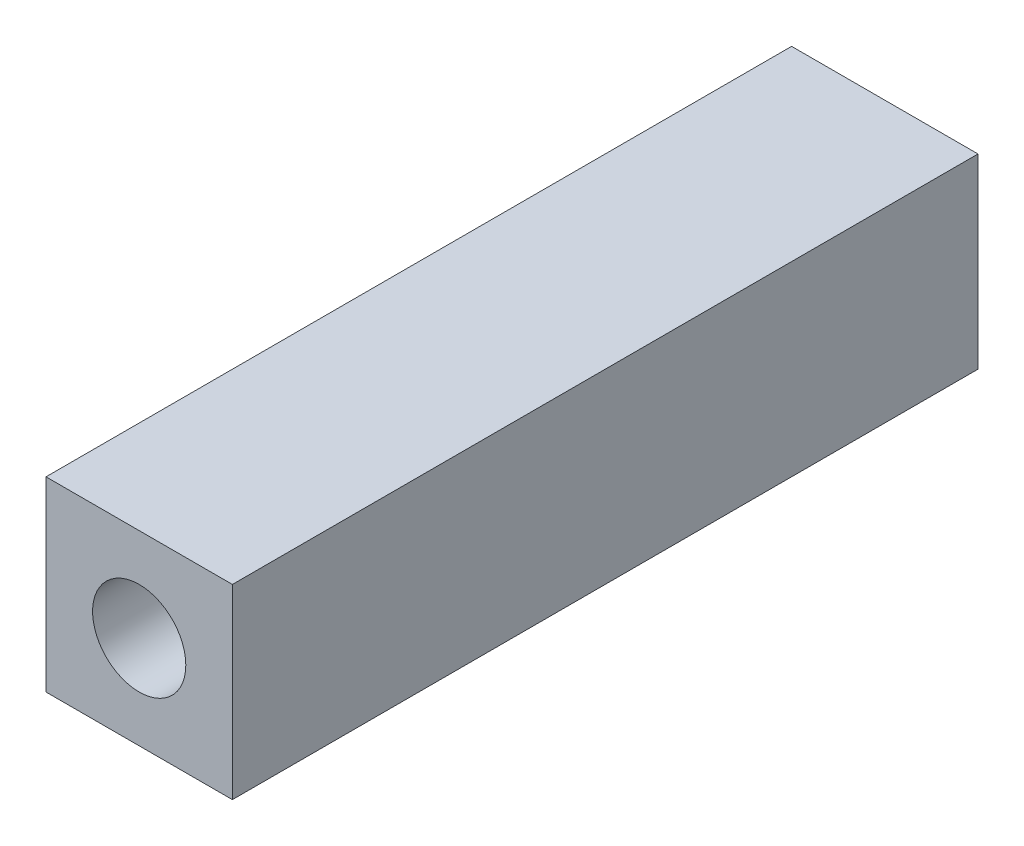
ISO-10303-21;
HEADER;
FILE_DESCRIPTION(('STEP AP214'),'2;1');
FILE_NAME('part.step','',(''),(''),'','','');
FILE_SCHEMA(('AUTOMOTIVE_DESIGN { 1 0 10303 214 1 1 1 1 }'));
ENDSEC;
DATA;
#1=APPLICATION_CONTEXT('core data for automotive mechanical design processes');
#2=APPLICATION_PROTOCOL_DEFINITION('international standard','automotive_design',2000,#1);
#3=PRODUCT_CONTEXT('',#1,'mechanical');
#4=PRODUCT('Part','Part','',(#3));
#5=PRODUCT_RELATED_PRODUCT_CATEGORY('part','',(#4));
#6=PRODUCT_DEFINITION_FORMATION('','',#4);
#7=PRODUCT_DEFINITION_CONTEXT('part definition',#1,'design');
#8=PRODUCT_DEFINITION('design','',#6,#7);
#9=PRODUCT_DEFINITION_SHAPE('','',#8);
#10=(LENGTH_UNIT() NAMED_UNIT(*) SI_UNIT(.MILLI.,.METRE.));
#11=(NAMED_UNIT(*) PLANE_ANGLE_UNIT() SI_UNIT($,.RADIAN.));
#12=(NAMED_UNIT(*) SI_UNIT($,.STERADIAN.) SOLID_ANGLE_UNIT());
#13=UNCERTAINTY_MEASURE_WITH_UNIT(LENGTH_MEASURE(1.E-05),#10,'distance_accuracy_value','');
#14=(GEOMETRIC_REPRESENTATION_CONTEXT(3) GLOBAL_UNCERTAINTY_ASSIGNED_CONTEXT((#13)) GLOBAL_UNIT_ASSIGNED_CONTEXT((#10,
#11,#12)) REPRESENTATION_CONTEXT('',''));
#15=CARTESIAN_POINT('',(0.,0.,0.));
#16=DIRECTION('',(0.,0.,1.));
#17=DIRECTION('',(1.,0.,0.));
#18=AXIS2_PLACEMENT_3D('',#15,#16,#17);
#19=CARTESIAN_POINT('',(0.,0.,40.));
#20=DIRECTION('',(0.,0.,1.));
#21=DIRECTION('',(1.,0.,0.));
#22=AXIS2_PLACEMENT_3D('',#19,#20,#21);
#23=PLANE('',#22);
#24=DIRECTION('',(0.,1.,0.));
#25=VECTOR('',#24,1.);
#26=CARTESIAN_POINT('',(5.,5.,40.));
#27=LINE('',#26,#25);
#28=CARTESIAN_POINT('',(5.,-5.,40.));
#29=VERTEX_POINT('',#28);
#30=CARTESIAN_POINT('',(5.,5.,40.));
#31=VERTEX_POINT('',#30);
#32=EDGE_CURVE('E86',#29,#31,#27,.T.);
#33=ORIENTED_EDGE('',*,*,#32,.T.);
#34=DIRECTION('',(-1.,0.,0.));
#35=VECTOR('',#34,1.);
#36=CARTESIAN_POINT('',(-5.,5.,40.));
#37=LINE('',#36,#35);
#38=CARTESIAN_POINT('',(-5.,5.,40.));
#39=VERTEX_POINT('',#38);
#40=EDGE_CURVE('E81',#31,#39,#37,.T.);
#41=ORIENTED_EDGE('',*,*,#40,.T.);
#42=DIRECTION('',(0.,-1.,0.));
#43=VECTOR('',#42,1.);
#44=CARTESIAN_POINT('',(-5.,5.,40.));
#45=LINE('',#44,#43);
#46=CARTESIAN_POINT('',(-5.,-5.,40.));
#47=VERTEX_POINT('',#46);
#48=EDGE_CURVE('E84',#39,#47,#45,.T.);
#49=ORIENTED_EDGE('',*,*,#48,.T.);
#50=DIRECTION('',(1.,0.,0.));
#51=VECTOR('',#50,1.);
#52=CARTESIAN_POINT('',(-5.,-5.,40.));
#53=LINE('',#52,#51);
#54=EDGE_CURVE('E51',#47,#29,#53,.T.);
#55=ORIENTED_EDGE('',*,*,#54,.T.);
#56=EDGE_LOOP('',(#33,#41,#49,#55));
#57=FACE_BOUND('',#56,.T.);
#58=CARTESIAN_POINT('',(0.,0.,40.));
#59=DIRECTION('',(0.,0.,1.));
#60=DIRECTION('',(1.,0.,0.));
#61=AXIS2_PLACEMENT_3D('',#58,#59,#60);
#62=CIRCLE('',#61,2.5);
#63=CARTESIAN_POINT('',(2.5,0.,40.));
#64=VERTEX_POINT('',#63);
#65=EDGE_CURVE('E101',#64,#64,#62,.T.);
#66=ORIENTED_EDGE('',*,*,#65,.F.);
#67=EDGE_LOOP('',(#66));
#68=FACE_BOUND('',#67,.T.);
#69=ADVANCED_FACE('F34',(#57,#68),#23,.T.);
#70=CARTESIAN_POINT('',(0.,0.,0.));
#71=DIRECTION('',(0.,0.,1.));
#72=DIRECTION('',(1.,0.,0.));
#73=AXIS2_PLACEMENT_3D('',#70,#71,#72);
#74=PLANE('',#73);
#75=DIRECTION('',(0.,1.,0.));
#76=VECTOR('',#75,1.);
#77=CARTESIAN_POINT('',(5.,5.,0.));
#78=LINE('',#77,#76);
#79=CARTESIAN_POINT('',(5.,-5.,0.));
#80=VERTEX_POINT('',#79);
#81=CARTESIAN_POINT('',(5.,5.,0.));
#82=VERTEX_POINT('',#81);
#83=EDGE_CURVE('E98',#80,#82,#78,.T.);
#84=ORIENTED_EDGE('',*,*,#83,.F.);
#85=DIRECTION('',(1.,0.,0.));
#86=VECTOR('',#85,1.);
#87=CARTESIAN_POINT('',(-5.,-5.,0.));
#88=LINE('',#87,#86);
#89=CARTESIAN_POINT('',(-5.,-5.,0.));
#90=VERTEX_POINT('',#89);
#91=EDGE_CURVE('E74',#90,#80,#88,.T.);
#92=ORIENTED_EDGE('',*,*,#91,.F.);
#93=DIRECTION('',(0.,-1.,0.));
#94=VECTOR('',#93,1.);
#95=CARTESIAN_POINT('',(-5.,5.,0.));
#96=LINE('',#95,#94);
#97=CARTESIAN_POINT('',(-5.,5.,0.));
#98=VERTEX_POINT('',#97);
#99=EDGE_CURVE('E68',#98,#90,#96,.T.);
#100=ORIENTED_EDGE('',*,*,#99,.F.);
#101=DIRECTION('',(-1.,0.,0.));
#102=VECTOR('',#101,1.);
#103=CARTESIAN_POINT('',(-5.,5.,0.));
#104=LINE('',#103,#102);
#105=EDGE_CURVE('E90',#82,#98,#104,.T.);
#106=ORIENTED_EDGE('',*,*,#105,.F.);
#107=EDGE_LOOP('',(#84,#92,#100,#106));
#108=FACE_BOUND('',#107,.T.);
#109=CARTESIAN_POINT('',(0.,0.,0.));
#110=DIRECTION('',(0.,0.,1.));
#111=DIRECTION('',(1.,0.,0.));
#112=AXIS2_PLACEMENT_3D('',#109,#110,#111);
#113=CIRCLE('',#112,2.5);
#114=CARTESIAN_POINT('',(2.5,0.,0.));
#115=VERTEX_POINT('',#114);
#116=EDGE_CURVE('E113',#115,#115,#113,.T.);
#117=ORIENTED_EDGE('',*,*,#116,.T.);
#118=EDGE_LOOP('',(#117));
#119=FACE_BOUND('',#118,.T.);
#120=ADVANCED_FACE('F109',(#108,#119),#74,.F.);
#121=CARTESIAN_POINT('',(5.,5.,40.));
#122=DIRECTION('',(-1.,0.,0.));
#123=DIRECTION('',(0.,0.,1.));
#124=AXIS2_PLACEMENT_3D('',#121,#122,#123);
#125=PLANE('',#124);
#126=ORIENTED_EDGE('',*,*,#83,.T.);
#127=DIRECTION('',(0.,0.,-1.));
#128=VECTOR('',#127,1.);
#129=CARTESIAN_POINT('',(5.,5.,40.));
#130=LINE('',#129,#128);
#131=EDGE_CURVE('E11',#31,#82,#130,.T.);
#132=ORIENTED_EDGE('',*,*,#131,.F.);
#133=ORIENTED_EDGE('',*,*,#32,.F.);
#134=DIRECTION('',(0.,0.,-1.));
#135=VECTOR('',#134,1.);
#136=CARTESIAN_POINT('',(5.,-5.,40.));
#137=LINE('',#136,#135);
#138=EDGE_CURVE('E94',#29,#80,#137,.T.);
#139=ORIENTED_EDGE('',*,*,#138,.T.);
#140=EDGE_LOOP('',(#126,#132,#133,#139));
#141=FACE_BOUND('',#140,.T.);
#142=ADVANCED_FACE('F36',(#141),#125,.F.);
#143=CARTESIAN_POINT('',(-5.,5.,40.));
#144=DIRECTION('',(0.,-1.,0.));
#145=DIRECTION('',(0.,0.,-1.));
#146=AXIS2_PLACEMENT_3D('',#143,#144,#145);
#147=PLANE('',#146);
#148=ORIENTED_EDGE('',*,*,#105,.T.);
#149=DIRECTION('',(0.,0.,-1.));
#150=VECTOR('',#149,1.);
#151=CARTESIAN_POINT('',(-5.,5.,40.));
#152=LINE('',#151,#150);
#153=EDGE_CURVE('E43',#39,#98,#152,.T.);
#154=ORIENTED_EDGE('',*,*,#153,.F.);
#155=ORIENTED_EDGE('',*,*,#40,.F.);
#156=ORIENTED_EDGE('',*,*,#131,.T.);
#157=EDGE_LOOP('',(#148,#154,#155,#156));
#158=FACE_BOUND('',#157,.T.);
#159=ADVANCED_FACE('F89',(#158),#147,.F.);
#160=CARTESIAN_POINT('',(-5.,5.,40.));
#161=DIRECTION('',(1.,0.,0.));
#162=DIRECTION('',(0.,1.,0.));
#163=AXIS2_PLACEMENT_3D('',#160,#161,#162);
#164=PLANE('',#163);
#165=ORIENTED_EDGE('',*,*,#99,.T.);
#166=DIRECTION('',(0.,0.,-1.));
#167=VECTOR('',#166,1.);
#168=CARTESIAN_POINT('',(-5.,-5.,40.));
#169=LINE('',#168,#167);
#170=EDGE_CURVE('E91',#47,#90,#169,.T.);
#171=ORIENTED_EDGE('',*,*,#170,.F.);
#172=ORIENTED_EDGE('',*,*,#48,.F.);
#173=ORIENTED_EDGE('',*,*,#153,.T.);
#174=EDGE_LOOP('',(#165,#171,#172,#173));
#175=FACE_BOUND('',#174,.T.);
#176=ADVANCED_FACE('F92',(#175),#164,.F.);
#177=CARTESIAN_POINT('',(-5.,-5.,40.));
#178=DIRECTION('',(0.,1.,0.));
#179=DIRECTION('',(0.,0.,1.));
#180=AXIS2_PLACEMENT_3D('',#177,#178,#179);
#181=PLANE('',#180);
#182=ORIENTED_EDGE('',*,*,#91,.T.);
#183=ORIENTED_EDGE('',*,*,#138,.F.);
#184=ORIENTED_EDGE('',*,*,#54,.F.);
#185=ORIENTED_EDGE('',*,*,#170,.T.);
#186=EDGE_LOOP('',(#182,#183,#184,#185));
#187=FACE_BOUND('',#186,.T.);
#188=ADVANCED_FACE('F106',(#187),#181,.F.);
#189=CARTESIAN_POINT('',(0.,0.,40.));
#190=DIRECTION('',(0.,0.,-1.));
#191=DIRECTION('',(-1.,0.,0.));
#192=AXIS2_PLACEMENT_3D('',#189,#190,#191);
#193=CYLINDRICAL_SURFACE('',#192,2.5);
#194=ORIENTED_EDGE('',*,*,#65,.T.);
#195=EDGE_LOOP('',(#194));
#196=FACE_BOUND('',#195,.T.);
#197=ORIENTED_EDGE('',*,*,#116,.F.);
#198=EDGE_LOOP('',(#197));
#199=FACE_BOUND('',#198,.T.);
#200=ADVANCED_FACE('F119',(#196,#199),#193,.F.);
#201=CLOSED_SHELL('',(#69,#120,#142,#159,#176,#188,#200));
#202=MANIFOLD_SOLID_BREP('B2',#201);
#203=ADVANCED_BREP_SHAPE_REPRESENTATION('',(#18,#202),#14);
#204=SHAPE_DEFINITION_REPRESENTATION(#9,#203);
ENDSEC;
END-ISO-10303-21;
